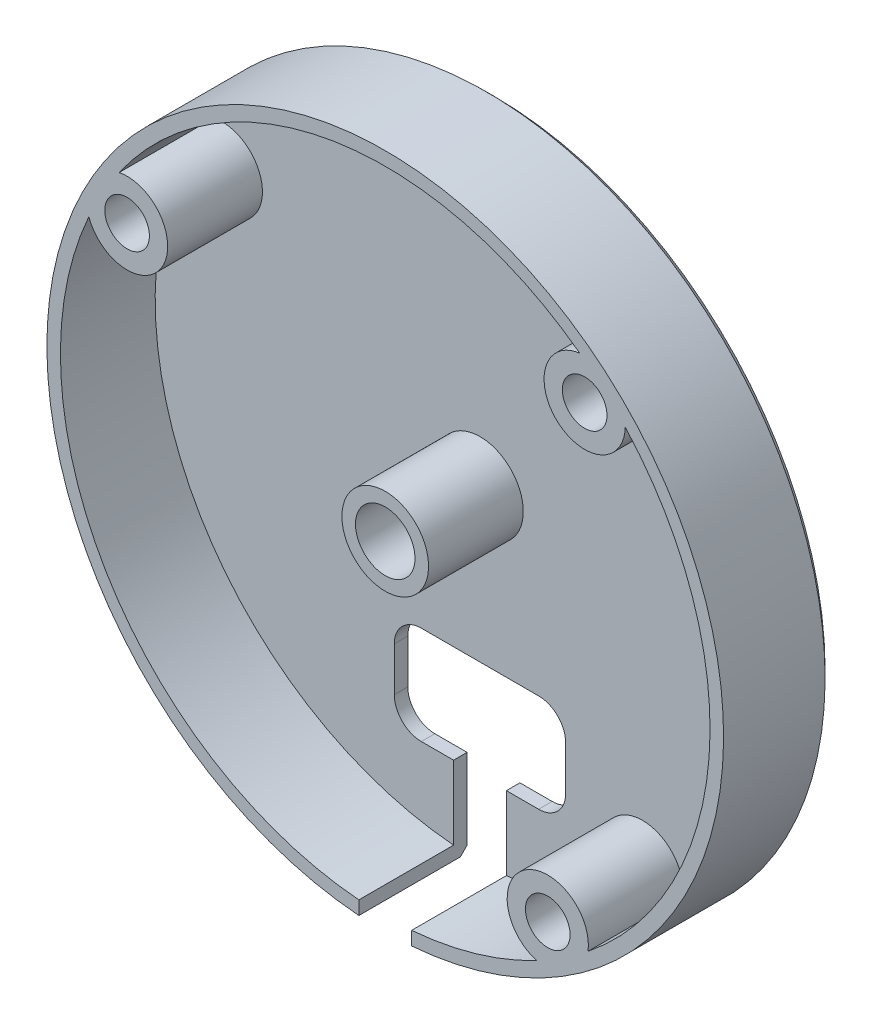
ISO-10303-21;
HEADER;
FILE_DESCRIPTION(('STEP AP214'),'2;1');
FILE_NAME('part.step','',(''),(''),'','','');
FILE_SCHEMA(('AUTOMOTIVE_DESIGN { 1 0 10303 214 1 1 1 1 }'));
ENDSEC;
DATA;
#1=APPLICATION_CONTEXT('core data for automotive mechanical design processes');
#2=APPLICATION_PROTOCOL_DEFINITION('international standard','automotive_design',2000,#1);
#3=PRODUCT_CONTEXT('',#1,'mechanical');
#4=PRODUCT('Part','Part','',(#3));
#5=PRODUCT_RELATED_PRODUCT_CATEGORY('part','',(#4));
#6=PRODUCT_DEFINITION_FORMATION('','',#4);
#7=PRODUCT_DEFINITION_CONTEXT('part definition',#1,'design');
#8=PRODUCT_DEFINITION('design','',#6,#7);
#9=PRODUCT_DEFINITION_SHAPE('','',#8);
#10=(LENGTH_UNIT() NAMED_UNIT(*) SI_UNIT(.MILLI.,.METRE.));
#11=(NAMED_UNIT(*) PLANE_ANGLE_UNIT() SI_UNIT($,.RADIAN.));
#12=(NAMED_UNIT(*) SI_UNIT($,.STERADIAN.) SOLID_ANGLE_UNIT());
#13=UNCERTAINTY_MEASURE_WITH_UNIT(LENGTH_MEASURE(1.E-05),#10,'distance_accuracy_value','');
#14=(GEOMETRIC_REPRESENTATION_CONTEXT(3) GLOBAL_UNCERTAINTY_ASSIGNED_CONTEXT((#13)) GLOBAL_UNIT_ASSIGNED_CONTEXT((#10,
#11,#12)) REPRESENTATION_CONTEXT('',''));
#15=CARTESIAN_POINT('',(0.,0.,0.));
#16=DIRECTION('',(0.,0.,1.));
#17=DIRECTION('',(1.,0.,0.));
#18=AXIS2_PLACEMENT_3D('',#15,#16,#17);
#19=CARTESIAN_POINT('',(0.,0.,-9.));
#20=DIRECTION('',(0.,0.,-1.));
#21=DIRECTION('',(-1.,0.,0.));
#22=AXIS2_PLACEMENT_3D('',#19,#20,#21);
#23=PLANE('',#22);
#24=CARTESIAN_POINT('',(0.,0.,-9.));
#25=DIRECTION('',(0.,0.,-1.));
#26=DIRECTION('',(-1.,0.,0.));
#27=AXIS2_PLACEMENT_3D('',#24,#25,#26);
#28=CIRCLE('',#27,3.2);
#29=CARTESIAN_POINT('',(-3.2,0.,-9.));
#30=VERTEX_POINT('',#29);
#31=EDGE_CURVE('E326',#30,#30,#28,.T.);
#32=ORIENTED_EDGE('',*,*,#31,.T.);
#33=EDGE_LOOP('',(#32));
#34=FACE_BOUND('',#33,.T.);
#35=DIRECTION('',(0.,1.,0.));
#36=VECTOR('',#35,1.);
#37=CARTESIAN_POINT('',(1.95,0.,-9.));
#38=LINE('',#37,#36);
#39=CARTESIAN_POINT('',(1.95,-23.9206500747785,-9.));
#40=VERTEX_POINT('',#39);
#41=CARTESIAN_POINT('',(1.95,-18.4814555776076,-9.));
#42=VERTEX_POINT('',#41);
#43=EDGE_CURVE('E494',#40,#42,#38,.T.);
#44=ORIENTED_EDGE('',*,*,#43,.F.);
#45=CARTESIAN_POINT('',(0.,0.,-9.));
#46=DIRECTION('',(0.,0.,-1.));
#47=DIRECTION('',(-1.,0.,0.));
#48=AXIS2_PLACEMENT_3D('',#45,#46,#47);
#49=CIRCLE('',#48,24.);
#50=CARTESIAN_POINT('',(11.1833588227535,-21.2351709539043,-9.));
#51=VERTEX_POINT('',#50);
#52=EDGE_CURVE('E325',#51,#40,#49,.T.);
#53=ORIENTED_EDGE('',*,*,#52,.F.);
#54=CARTESIAN_POINT('',(12.00918454324,-18.3510745825286,-9.));
#55=DIRECTION('',(0.,0.,-1.));
#56=DIRECTION('',(-1.,0.,0.));
#57=AXIS2_PLACEMENT_3D('',#54,#55,#56);
#58=CIRCLE('',#57,3.);
#59=CARTESIAN_POINT('',(14.9826990358569,-18.7488327530258,-9.));
#60=VERTEX_POINT('',#59);
#61=EDGE_CURVE('E277',#51,#60,#58,.T.);
#62=ORIENTED_EDGE('',*,*,#61,.T.);
#63=CARTESIAN_POINT('',(17.7346250390881,16.1704382971813,-9.));
#64=VERTEX_POINT('',#63);
#65=EDGE_CURVE('E320',#64,#60,#49,.T.);
#66=ORIENTED_EDGE('',*,*,#65,.F.);
#67=CARTESIAN_POINT('',(14.7355117330946,16.2433723620113,-9.));
#68=DIRECTION('',(0.,0.,-1.));
#69=DIRECTION('',(-1.,0.,0.));
#70=AXIS2_PLACEMENT_3D('',#67,#68,#69);
#71=CIRCLE('',#70,3.);
#72=CARTESIAN_POINT('',(14.371655882494,19.2212254342739,-9.));
#73=VERTEX_POINT('',#72);
#74=EDGE_CURVE('E296',#64,#73,#71,.T.);
#75=ORIENTED_EDGE('',*,*,#74,.T.);
#76=CARTESIAN_POINT('',(-19.6594045017494,13.7661837353929,-9.));
#77=VERTEX_POINT('',#76);
#78=EDGE_CURVE('E335',#77,#73,#49,.T.);
#79=ORIENTED_EDGE('',*,*,#78,.F.);
#80=CARTESIAN_POINT('',(-19.0742703827249,10.8238006769259,-9.));
#81=DIRECTION('',(0.,0.,-1.));
#82=DIRECTION('',(-1.,0.,0.));
#83=AXIS2_PLACEMENT_3D('',#80,#81,#82);
#84=CIRCLE('',#83,3.);
#85=CARTESIAN_POINT('',(-21.9003251075439,9.81711567538458,-9.));
#86=VERTEX_POINT('',#85);
#87=EDGE_CURVE('E259',#77,#86,#84,.T.);
#88=ORIENTED_EDGE('',*,*,#87,.T.);
#89=CARTESIAN_POINT('',(-1.95,-23.9206500747785,-9.));
#90=VERTEX_POINT('',#89);
#91=EDGE_CURVE('E213',#90,#86,#49,.T.);
#92=ORIENTED_EDGE('',*,*,#91,.F.);
#93=DIRECTION('',(0.,1.,0.));
#94=VECTOR('',#93,1.);
#95=CARTESIAN_POINT('',(-1.95,0.,-9.));
#96=LINE('',#95,#94);
#97=CARTESIAN_POINT('',(-1.95,-18.4814555776076,-9.00000000000001));
#98=VERTEX_POINT('',#97);
#99=EDGE_CURVE('E195',#90,#98,#96,.T.);
#100=ORIENTED_EDGE('',*,*,#99,.T.);
#101=DIRECTION('',(1.,0.,0.));
#102=VECTOR('',#101,1.);
#103=CARTESIAN_POINT('',(0.,-18.4814555776076,-9.));
#104=LINE('',#103,#102);
#105=CARTESIAN_POINT('',(-4.33229155248715,-18.4814555776076,-9.));
#106=VERTEX_POINT('',#105);
#107=EDGE_CURVE('E211',#106,#98,#104,.T.);
#108=ORIENTED_EDGE('',*,*,#107,.F.);
#109=CARTESIAN_POINT('',(-4.33229155248716,-16.4814555776076,-9.00000000000001));
#110=DIRECTION('',(0.,0.,-1.));
#111=DIRECTION('',(-1.,0.,0.));
#112=AXIS2_PLACEMENT_3D('',#109,#110,#111);
#113=CIRCLE('',#112,2.);
#114=CARTESIAN_POINT('',(-6.33229155248716,-16.4814555776076,-9.00000000000001));
#115=VERTEX_POINT('',#114);
#116=EDGE_CURVE('E247',#115,#106,#113,.F.);
#117=ORIENTED_EDGE('',*,*,#116,.F.);
#118=DIRECTION('',(0.,-1.,0.));
#119=VECTOR('',#118,1.);
#120=CARTESIAN_POINT('',(-6.33229155248716,0.,-9.));
#121=LINE('',#120,#119);
#122=CARTESIAN_POINT('',(-6.33229155248716,-13.2289331322741,-9.00000000000001));
#123=VERTEX_POINT('',#122);
#124=EDGE_CURVE('E244',#123,#115,#121,.T.);
#125=ORIENTED_EDGE('',*,*,#124,.F.);
#126=CARTESIAN_POINT('',(-4.33229155248716,-13.2289331322741,-9.00000000000001));
#127=DIRECTION('',(0.,0.,-1.));
#128=DIRECTION('',(-1.,0.,0.));
#129=AXIS2_PLACEMENT_3D('',#126,#127,#128);
#130=CIRCLE('',#129,2.);
#131=CARTESIAN_POINT('',(-4.33229155248715,-11.2289331322741,-9.00000000000001));
#132=VERTEX_POINT('',#131);
#133=EDGE_CURVE('E241',#132,#123,#130,.F.);
#134=ORIENTED_EDGE('',*,*,#133,.F.);
#135=DIRECTION('',(-1.,0.,0.));
#136=VECTOR('',#135,1.);
#137=CARTESIAN_POINT('',(0.,-11.2289331322741,-9.));
#138=LINE('',#137,#136);
#139=CARTESIAN_POINT('',(4.33229155248716,-11.2289331322741,-9.00000000000001));
#140=VERTEX_POINT('',#139);
#141=EDGE_CURVE('E238',#140,#132,#138,.T.);
#142=ORIENTED_EDGE('',*,*,#141,.F.);
#143=CARTESIAN_POINT('',(4.33229155248716,-13.2289331322741,-9.00000000000001));
#144=DIRECTION('',(0.,0.,-1.));
#145=DIRECTION('',(-1.,0.,0.));
#146=AXIS2_PLACEMENT_3D('',#143,#144,#145);
#147=CIRCLE('',#146,2.);
#148=CARTESIAN_POINT('',(6.33229155248716,-13.2289331322741,-9.00000000000001));
#149=VERTEX_POINT('',#148);
#150=EDGE_CURVE('E235',#149,#140,#147,.F.);
#151=ORIENTED_EDGE('',*,*,#150,.F.);
#152=DIRECTION('',(0.,1.,0.));
#153=VECTOR('',#152,1.);
#154=CARTESIAN_POINT('',(6.33229155248716,0.,-9.));
#155=LINE('',#154,#153);
#156=CARTESIAN_POINT('',(6.33229155248716,-16.4814555776076,-9.00000000000001));
#157=VERTEX_POINT('',#156);
#158=EDGE_CURVE('E227',#157,#149,#155,.T.);
#159=ORIENTED_EDGE('',*,*,#158,.F.);
#160=CARTESIAN_POINT('',(4.33229155248716,-16.4814555776076,-9.00000000000001));
#161=DIRECTION('',(0.,0.,-1.));
#162=DIRECTION('',(-1.,0.,0.));
#163=AXIS2_PLACEMENT_3D('',#160,#161,#162);
#164=CIRCLE('',#163,2.);
#165=CARTESIAN_POINT('',(4.33229155248716,-18.4814555776076,-9.00000000000001));
#166=VERTEX_POINT('',#165);
#167=EDGE_CURVE('E222',#166,#157,#164,.F.);
#168=ORIENTED_EDGE('',*,*,#167,.F.);
#169=EDGE_CURVE('E223',#42,#166,#104,.T.);
#170=ORIENTED_EDGE('',*,*,#169,.F.);
#171=EDGE_LOOP('',(#44,#53,#62,#66,#75,#79,#88,#92,#100,#108,#117,#125,#134,#142,#151,#159,#168,#170));
#172=FACE_BOUND('',#171,.T.);
#173=ADVANCED_FACE('F44',(#34,#172),#23,.F.);
#174=CARTESIAN_POINT('',(0.,0.,-10.));
#175=DIRECTION('',(0.,0.,-1.));
#176=DIRECTION('',(-1.,0.,0.));
#177=AXIS2_PLACEMENT_3D('',#174,#175,#176);
#178=PLANE('',#177);
#179=CARTESIAN_POINT('',(14.7355117330946,16.2433723620113,-10.));
#180=DIRECTION('',(0.,0.,-1.));
#181=DIRECTION('',(-1.,0.,0.));
#182=AXIS2_PLACEMENT_3D('',#179,#180,#181);
#183=CIRCLE('',#182,1.65);
#184=CARTESIAN_POINT('',(13.0855117330946,16.2433723620113,-10.));
#185=VERTEX_POINT('',#184);
#186=EDGE_CURVE('E315',#185,#185,#183,.T.);
#187=ORIENTED_EDGE('',*,*,#186,.F.);
#188=EDGE_LOOP('',(#187));
#189=FACE_BOUND('',#188,.T.);
#190=CARTESIAN_POINT('',(12.00918454324,-18.3510745825286,-10.));
#191=DIRECTION('',(0.,0.,-1.));
#192=DIRECTION('',(-1.,0.,0.));
#193=AXIS2_PLACEMENT_3D('',#190,#191,#192);
#194=CIRCLE('',#193,1.65000000000001);
#195=CARTESIAN_POINT('',(10.35918454324,-18.3510745825286,-10.));
#196=VERTEX_POINT('',#195);
#197=EDGE_CURVE('E311',#196,#196,#194,.T.);
#198=ORIENTED_EDGE('',*,*,#197,.F.);
#199=EDGE_LOOP('',(#198));
#200=FACE_BOUND('',#199,.T.);
#201=CARTESIAN_POINT('',(-19.0742703827249,10.8238006769259,-10.));
#202=DIRECTION('',(0.,0.,-1.));
#203=DIRECTION('',(-1.,0.,0.));
#204=AXIS2_PLACEMENT_3D('',#201,#202,#203);
#205=CIRCLE('',#204,1.65);
#206=CARTESIAN_POINT('',(-20.7242703827249,10.8238006769259,-10.));
#207=VERTEX_POINT('',#206);
#208=EDGE_CURVE('E300',#207,#207,#205,.T.);
#209=ORIENTED_EDGE('',*,*,#208,.F.);
#210=EDGE_LOOP('',(#209));
#211=FACE_BOUND('',#210,.T.);
#212=CARTESIAN_POINT('',(0.,0.,-10.));
#213=DIRECTION('',(0.,0.,-1.));
#214=DIRECTION('',(-1.,0.,0.));
#215=AXIS2_PLACEMENT_3D('',#212,#213,#214);
#216=CIRCLE('',#215,2.2);
#217=CARTESIAN_POINT('',(-2.2,0.,-10.));
#218=VERTEX_POINT('',#217);
#219=EDGE_CURVE('E341',#218,#218,#216,.T.);
#220=ORIENTED_EDGE('',*,*,#219,.F.);
#221=EDGE_LOOP('',(#220));
#222=FACE_BOUND('',#221,.T.);
#223=DIRECTION('',(0.,1.,0.));
#224=VECTOR('',#223,1.);
#225=CARTESIAN_POINT('',(-1.95,0.,-10.));
#226=LINE('',#225,#224);
#227=CARTESIAN_POINT('',(-1.95,-24.4222746688346,-10.));
#228=VERTEX_POINT('',#227);
#229=CARTESIAN_POINT('',(-1.95,-18.4814555776076,-10.));
#230=VERTEX_POINT('',#229);
#231=EDGE_CURVE('E198',#228,#230,#226,.T.);
#232=ORIENTED_EDGE('',*,*,#231,.F.);
#233=CARTESIAN_POINT('',(0.,0.,-10.));
#234=DIRECTION('',(0.,0.,-1.));
#235=DIRECTION('',(-1.,0.,0.));
#236=AXIS2_PLACEMENT_3D('',#233,#234,#235);
#237=CIRCLE('',#236,24.5);
#238=CARTESIAN_POINT('',(1.95,-24.4222746688346,-10.));
#239=VERTEX_POINT('',#238);
#240=EDGE_CURVE('E386',#228,#239,#237,.T.);
#241=ORIENTED_EDGE('',*,*,#240,.T.);
#242=DIRECTION('',(0.,1.,0.));
#243=VECTOR('',#242,1.);
#244=CARTESIAN_POINT('',(1.95,0.,-10.));
#245=LINE('',#244,#243);
#246=CARTESIAN_POINT('',(1.95,-18.4814555776076,-9.99999999999999));
#247=VERTEX_POINT('',#246);
#248=EDGE_CURVE('E574',#239,#247,#245,.T.);
#249=ORIENTED_EDGE('',*,*,#248,.T.);
#250=DIRECTION('',(1.,0.,0.));
#251=VECTOR('',#250,1.);
#252=CARTESIAN_POINT('',(0.,-18.4814555776076,-10.));
#253=LINE('',#252,#251);
#254=CARTESIAN_POINT('',(4.33229155248716,-18.4814555776076,-10.));
#255=VERTEX_POINT('',#254);
#256=EDGE_CURVE('E352',#247,#255,#253,.T.);
#257=ORIENTED_EDGE('',*,*,#256,.T.);
#258=CARTESIAN_POINT('',(4.33229155248716,-16.4814555776076,-9.99999999999999));
#259=DIRECTION('',(0.,0.,-1.));
#260=DIRECTION('',(-1.,0.,0.));
#261=AXIS2_PLACEMENT_3D('',#258,#259,#260);
#262=CIRCLE('',#261,2.);
#263=CARTESIAN_POINT('',(6.33229155248716,-16.4814555776076,-9.99999999999999));
#264=VERTEX_POINT('',#263);
#265=EDGE_CURVE('E356',#255,#264,#262,.F.);
#266=ORIENTED_EDGE('',*,*,#265,.T.);
#267=DIRECTION('',(0.,1.,0.));
#268=VECTOR('',#267,1.);
#269=CARTESIAN_POINT('',(6.33229155248716,0.,-10.));
#270=LINE('',#269,#268);
#271=CARTESIAN_POINT('',(6.33229155248716,-13.2289331322741,-9.99999999999999));
#272=VERTEX_POINT('',#271);
#273=EDGE_CURVE('E360',#264,#272,#270,.T.);
#274=ORIENTED_EDGE('',*,*,#273,.T.);
#275=CARTESIAN_POINT('',(4.33229155248716,-13.2289331322741,-9.99999999999999));
#276=DIRECTION('',(0.,0.,-1.));
#277=DIRECTION('',(-1.,0.,0.));
#278=AXIS2_PLACEMENT_3D('',#275,#276,#277);
#279=CIRCLE('',#278,2.);
#280=CARTESIAN_POINT('',(4.33229155248716,-11.2289331322741,-9.99999999999999));
#281=VERTEX_POINT('',#280);
#282=EDGE_CURVE('E364',#272,#281,#279,.F.);
#283=ORIENTED_EDGE('',*,*,#282,.T.);
#284=DIRECTION('',(-1.,0.,0.));
#285=VECTOR('',#284,1.);
#286=CARTESIAN_POINT('',(0.,-11.2289331322741,-10.));
#287=LINE('',#286,#285);
#288=CARTESIAN_POINT('',(-4.33229155248715,-11.2289331322741,-9.99999999999999));
#289=VERTEX_POINT('',#288);
#290=EDGE_CURVE('E368',#281,#289,#287,.T.);
#291=ORIENTED_EDGE('',*,*,#290,.T.);
#292=CARTESIAN_POINT('',(-4.33229155248716,-13.2289331322741,-9.99999999999999));
#293=DIRECTION('',(0.,0.,-1.));
#294=DIRECTION('',(-1.,0.,0.));
#295=AXIS2_PLACEMENT_3D('',#292,#293,#294);
#296=CIRCLE('',#295,2.);
#297=CARTESIAN_POINT('',(-6.33229155248716,-13.2289331322741,-9.99999999999999));
#298=VERTEX_POINT('',#297);
#299=EDGE_CURVE('E372',#289,#298,#296,.F.);
#300=ORIENTED_EDGE('',*,*,#299,.T.);
#301=DIRECTION('',(0.,-1.,0.));
#302=VECTOR('',#301,1.);
#303=CARTESIAN_POINT('',(-6.33229155248716,0.,-10.));
#304=LINE('',#303,#302);
#305=CARTESIAN_POINT('',(-6.33229155248716,-16.4814555776076,-9.99999999999999));
#306=VERTEX_POINT('',#305);
#307=EDGE_CURVE('E376',#298,#306,#304,.T.);
#308=ORIENTED_EDGE('',*,*,#307,.T.);
#309=CARTESIAN_POINT('',(-4.33229155248716,-16.4814555776076,-9.99999999999999));
#310=DIRECTION('',(0.,0.,-1.));
#311=DIRECTION('',(-1.,0.,0.));
#312=AXIS2_PLACEMENT_3D('',#309,#310,#311);
#313=CIRCLE('',#312,2.);
#314=CARTESIAN_POINT('',(-4.33229155248715,-18.4814555776076,-9.99999999999999));
#315=VERTEX_POINT('',#314);
#316=EDGE_CURVE('E204',#306,#315,#313,.F.);
#317=ORIENTED_EDGE('',*,*,#316,.T.);
#318=EDGE_CURVE('E353',#315,#230,#253,.T.);
#319=ORIENTED_EDGE('',*,*,#318,.T.);
#320=EDGE_LOOP('',(#232,#241,#249,#257,#266,#274,#283,#291,#300,#308,#317,#319));
#321=FACE_BOUND('',#320,.T.);
#322=ADVANCED_FACE('F460',(#189,#200,#211,#222,#321),#178,.T.);
#323=CARTESIAN_POINT('',(0.,0.,-10.));
#324=DIRECTION('',(0.,0.,1.));
#325=DIRECTION('',(1.,0.,0.));
#326=AXIS2_PLACEMENT_3D('',#323,#324,#325);
#327=CYLINDRICAL_SURFACE('',#326,24.);
#328=ORIENTED_EDGE('',*,*,#52,.T.);
#329=DIRECTION('',(0.,0.,1.));
#330=VECTOR('',#329,1.);
#331=CARTESIAN_POINT('',(1.95,-23.9206500747785,-10.));
#332=LINE('',#331,#330);
#333=CARTESIAN_POINT('',(1.95,-23.9206500747785,-2.));
#334=VERTEX_POINT('',#333);
#335=EDGE_CURVE('E524',#40,#334,#332,.T.);
#336=ORIENTED_EDGE('',*,*,#335,.T.);
#337=CARTESIAN_POINT('',(0.,0.,-2.));
#338=DIRECTION('',(0.,0.,-1.));
#339=DIRECTION('',(-1.,0.,0.));
#340=AXIS2_PLACEMENT_3D('',#337,#338,#339);
#341=CIRCLE('',#340,24.);
#342=CARTESIAN_POINT('',(11.1833588227535,-21.2351709539043,-2.));
#343=VERTEX_POINT('',#342);
#344=EDGE_CURVE('E336',#343,#334,#341,.T.);
#345=ORIENTED_EDGE('',*,*,#344,.F.);
#346=DIRECTION('',(0.,0.,1.));
#347=VECTOR('',#346,1.);
#348=CARTESIAN_POINT('',(11.1833588227535,-21.2351709539043,-5.5));
#349=LINE('',#348,#347);
#350=EDGE_CURVE('E282',#51,#343,#349,.T.);
#351=ORIENTED_EDGE('',*,*,#350,.F.);
#352=EDGE_LOOP('',(#328,#336,#345,#351));
#353=FACE_BOUND('',#352,.T.);
#354=ADVANCED_FACE('F468',(#353),#327,.F.);
#355=CARTESIAN_POINT('',(0.,0.,-2.));
#356=DIRECTION('',(0.,0.,-1.));
#357=DIRECTION('',(-1.,0.,0.));
#358=AXIS2_PLACEMENT_3D('',#355,#356,#357);
#359=PLANE('',#358);
#360=CARTESIAN_POINT('',(-19.0742703827249,10.8238006769259,-2.));
#361=DIRECTION('',(0.,0.,-1.));
#362=DIRECTION('',(-1.,0.,0.));
#363=AXIS2_PLACEMENT_3D('',#360,#361,#362);
#364=CIRCLE('',#363,1.65);
#365=CARTESIAN_POINT('',(-20.7242703827249,10.8238006769259,-2.));
#366=VERTEX_POINT('',#365);
#367=EDGE_CURVE('E251',#366,#366,#364,.T.);
#368=ORIENTED_EDGE('',*,*,#367,.T.);
#369=EDGE_LOOP('',(#368));
#370=FACE_BOUND('',#369,.T.);
#371=CARTESIAN_POINT('',(12.00918454324,-18.3510745825286,-2.));
#372=DIRECTION('',(0.,0.,-1.));
#373=DIRECTION('',(-1.,0.,0.));
#374=AXIS2_PLACEMENT_3D('',#371,#372,#373);
#375=CIRCLE('',#374,1.65);
#376=CARTESIAN_POINT('',(10.35918454324,-18.3510745825286,-2.));
#377=VERTEX_POINT('',#376);
#378=EDGE_CURVE('E270',#377,#377,#375,.T.);
#379=ORIENTED_EDGE('',*,*,#378,.T.);
#380=EDGE_LOOP('',(#379));
#381=FACE_BOUND('',#380,.T.);
#382=CARTESIAN_POINT('',(14.7355117330946,16.2433723620113,-2.));
#383=DIRECTION('',(0.,0.,-1.));
#384=DIRECTION('',(-1.,0.,0.));
#385=AXIS2_PLACEMENT_3D('',#382,#383,#384);
#386=CIRCLE('',#385,1.65);
#387=CARTESIAN_POINT('',(13.0855117330946,16.2433723620113,-2.));
#388=VERTEX_POINT('',#387);
#389=EDGE_CURVE('E288',#388,#388,#386,.T.);
#390=ORIENTED_EDGE('',*,*,#389,.T.);
#391=EDGE_LOOP('',(#390));
#392=FACE_BOUND('',#391,.T.);
#393=DIRECTION('',(0.,1.,0.));
#394=VECTOR('',#393,1.);
#395=CARTESIAN_POINT('',(1.95,0.,-2.));
#396=LINE('',#395,#394);
#397=CARTESIAN_POINT('',(1.95,-24.9238339747319,-2.));
#398=VERTEX_POINT('',#397);
#399=EDGE_CURVE('E493',#398,#334,#396,.T.);
#400=ORIENTED_EDGE('',*,*,#399,.F.);
#401=CARTESIAN_POINT('',(0.,0.,-2.));
#402=DIRECTION('',(0.,0.,-1.));
#403=DIRECTION('',(-1.,0.,0.));
#404=AXIS2_PLACEMENT_3D('',#401,#402,#403);
#405=CIRCLE('',#404,25.);
#406=CARTESIAN_POINT('',(-1.95,-24.9238339747319,-2.));
#407=VERTEX_POINT('',#406);
#408=EDGE_CURVE('E345',#407,#398,#405,.T.);
#409=ORIENTED_EDGE('',*,*,#408,.F.);
#410=DIRECTION('',(0.,1.,0.));
#411=VECTOR('',#410,1.);
#412=CARTESIAN_POINT('',(-1.95,0.,-2.));
#413=LINE('',#412,#411);
#414=CARTESIAN_POINT('',(-1.95,-23.9206500747785,-2.));
#415=VERTEX_POINT('',#414);
#416=EDGE_CURVE('E583',#407,#415,#413,.T.);
#417=ORIENTED_EDGE('',*,*,#416,.T.);
#418=CARTESIAN_POINT('',(-21.9003251075439,9.81711567538458,-2.));
#419=VERTEX_POINT('',#418);
#420=EDGE_CURVE('E337',#415,#419,#341,.T.);
#421=ORIENTED_EDGE('',*,*,#420,.T.);
#422=CARTESIAN_POINT('',(-19.0742703827249,10.8238006769259,-2.));
#423=DIRECTION('',(0.,0.,-1.));
#424=DIRECTION('',(-1.,0.,0.));
#425=AXIS2_PLACEMENT_3D('',#422,#423,#424);
#426=CIRCLE('',#425,3.);
#427=CARTESIAN_POINT('',(-19.6594045017494,13.7661837353929,-2.));
#428=VERTEX_POINT('',#427);
#429=EDGE_CURVE('E250',#428,#419,#426,.T.);
#430=ORIENTED_EDGE('',*,*,#429,.F.);
#431=CARTESIAN_POINT('',(14.371655882494,19.2212254342739,-2.));
#432=VERTEX_POINT('',#431);
#433=EDGE_CURVE('E330',#428,#432,#341,.T.);
#434=ORIENTED_EDGE('',*,*,#433,.T.);
#435=CARTESIAN_POINT('',(14.7355117330946,16.2433723620113,-2.));
#436=DIRECTION('',(0.,0.,-1.));
#437=DIRECTION('',(-1.,0.,0.));
#438=AXIS2_PLACEMENT_3D('',#435,#436,#437);
#439=CIRCLE('',#438,3.);
#440=CARTESIAN_POINT('',(17.7346250390881,16.1704382971813,-2.));
#441=VERTEX_POINT('',#440);
#442=EDGE_CURVE('E281',#441,#432,#439,.T.);
#443=ORIENTED_EDGE('',*,*,#442,.F.);
#444=CARTESIAN_POINT('',(14.9826990358569,-18.7488327530258,-2.));
#445=VERTEX_POINT('',#444);
#446=EDGE_CURVE('E331',#441,#445,#341,.T.);
#447=ORIENTED_EDGE('',*,*,#446,.T.);
#448=CARTESIAN_POINT('',(12.00918454324,-18.3510745825286,-2.));
#449=DIRECTION('',(0.,0.,-1.));
#450=DIRECTION('',(-1.,0.,0.));
#451=AXIS2_PLACEMENT_3D('',#448,#449,#450);
#452=CIRCLE('',#451,3.);
#453=EDGE_CURVE('E262',#343,#445,#452,.T.);
#454=ORIENTED_EDGE('',*,*,#453,.F.);
#455=ORIENTED_EDGE('',*,*,#344,.T.);
#456=EDGE_LOOP('',(#400,#409,#417,#421,#430,#434,#443,#447,#454,#455));
#457=FACE_BOUND('',#456,.T.);
#458=ADVANCED_FACE('F479',(#370,#381,#392,#457),#359,.F.);
#459=CARTESIAN_POINT('',(0.,0.,-10.));
#460=DIRECTION('',(0.,0.,1.));
#461=DIRECTION('',(1.,0.,0.));
#462=AXIS2_PLACEMENT_3D('',#459,#460,#461);
#463=CYLINDRICAL_SURFACE('',#462,25.);
#464=DIRECTION('',(0.,0.,1.));
#465=VECTOR('',#464,1.);
#466=CARTESIAN_POINT('',(1.95,-24.9238339747319,-10.));
#467=LINE('',#466,#465);
#468=CARTESIAN_POINT('',(1.95,-24.9238339747319,-9.49999999999999));
#469=VERTEX_POINT('',#468);
#470=EDGE_CURVE('E489',#469,#398,#467,.T.);
#471=ORIENTED_EDGE('',*,*,#470,.F.);
#472=CARTESIAN_POINT('',(0.,0.,-9.49999999999999));
#473=DIRECTION('',(0.,0.,-1.));
#474=DIRECTION('',(-1.,0.,0.));
#475=AXIS2_PLACEMENT_3D('',#472,#473,#474);
#476=CIRCLE('',#475,25.);
#477=CARTESIAN_POINT('',(-1.95,-24.9238339747319,-9.49999999999999));
#478=VERTEX_POINT('',#477);
#479=EDGE_CURVE('E60',#469,#478,#476,.F.);
#480=ORIENTED_EDGE('',*,*,#479,.T.);
#481=DIRECTION('',(0.,0.,1.));
#482=VECTOR('',#481,1.);
#483=CARTESIAN_POINT('',(-1.95,-24.9238339747319,-10.));
#484=LINE('',#483,#482);
#485=EDGE_CURVE('E215',#478,#407,#484,.T.);
#486=ORIENTED_EDGE('',*,*,#485,.T.);
#487=ORIENTED_EDGE('',*,*,#408,.T.);
#488=EDGE_LOOP('',(#471,#480,#486,#487));
#489=FACE_BOUND('',#488,.T.);
#490=ADVANCED_FACE('F481',(#489),#463,.T.);
#491=CARTESIAN_POINT('',(4.33229155248716,-18.4814555776076,-78.));
#492=DIRECTION('',(0.,1.,0.));
#493=DIRECTION('',(0.,0.,1.));
#494=AXIS2_PLACEMENT_3D('',#491,#492,#493);
#495=PLANE('',#494);
#496=ORIENTED_EDGE('',*,*,#256,.F.);
#497=DIRECTION('',(0.,0.,1.));
#498=VECTOR('',#497,1.);
#499=CARTESIAN_POINT('',(1.95,-18.4814555776076,-78.));
#500=LINE('',#499,#498);
#501=EDGE_CURVE('E203',#247,#42,#500,.T.);
#502=ORIENTED_EDGE('',*,*,#501,.T.);
#503=ORIENTED_EDGE('',*,*,#169,.T.);
#504=DIRECTION('',(0.,0.,1.));
#505=VECTOR('',#504,1.);
#506=CARTESIAN_POINT('',(4.33229155248716,-18.4814555776076,-78.));
#507=LINE('',#506,#505);
#508=EDGE_CURVE('E529',#255,#166,#507,.T.);
#509=ORIENTED_EDGE('',*,*,#508,.F.);
#510=EDGE_LOOP('',(#496,#502,#503,#509));
#511=FACE_BOUND('',#510,.T.);
#512=ADVANCED_FACE('F405',(#511),#495,.T.);
#513=DIRECTION('',(0.,0.,1.));
#514=VECTOR('',#513,1.);
#515=CARTESIAN_POINT('',(-1.95,-23.9206500747785,-10.));
#516=LINE('',#515,#514);
#517=EDGE_CURVE('E578',#90,#415,#516,.T.);
#518=ORIENTED_EDGE('',*,*,#517,.F.);
#519=ORIENTED_EDGE('',*,*,#91,.T.);
#520=DIRECTION('',(0.,0.,1.));
#521=VECTOR('',#520,1.);
#522=CARTESIAN_POINT('',(-21.9003251075439,9.81711567538458,-5.5));
#523=LINE('',#522,#521);
#524=EDGE_CURVE('E255',#419,#86,#523,.F.);
#525=ORIENTED_EDGE('',*,*,#524,.F.);
#526=ORIENTED_EDGE('',*,*,#420,.F.);
#527=EDGE_LOOP('',(#518,#519,#525,#526));
#528=FACE_BOUND('',#527,.T.);
#529=ADVANCED_FACE('F487',(#528),#327,.F.);
#530=ORIENTED_EDGE('',*,*,#433,.F.);
#531=DIRECTION('',(0.,0.,1.));
#532=VECTOR('',#531,1.);
#533=CARTESIAN_POINT('',(-19.6594045017494,13.7661837353929,-5.5));
#534=LINE('',#533,#532);
#535=EDGE_CURVE('E263',#77,#428,#534,.T.);
#536=ORIENTED_EDGE('',*,*,#535,.F.);
#537=ORIENTED_EDGE('',*,*,#78,.T.);
#538=DIRECTION('',(0.,0.,1.));
#539=VECTOR('',#538,1.);
#540=CARTESIAN_POINT('',(14.371655882494,19.2212254342738,-5.5));
#541=LINE('',#540,#539);
#542=EDGE_CURVE('E292',#432,#73,#541,.F.);
#543=ORIENTED_EDGE('',*,*,#542,.F.);
#544=EDGE_LOOP('',(#530,#536,#537,#543));
#545=FACE_BOUND('',#544,.T.);
#546=ADVANCED_FACE('F466',(#545),#327,.F.);
#547=ORIENTED_EDGE('',*,*,#65,.T.);
#548=DIRECTION('',(0.,0.,1.));
#549=VECTOR('',#548,1.);
#550=CARTESIAN_POINT('',(14.9826990358569,-18.7488327530258,-5.5));
#551=LINE('',#550,#549);
#552=EDGE_CURVE('E274',#445,#60,#551,.F.);
#553=ORIENTED_EDGE('',*,*,#552,.F.);
#554=ORIENTED_EDGE('',*,*,#446,.F.);
#555=DIRECTION('',(0.,0.,1.));
#556=VECTOR('',#555,1.);
#557=CARTESIAN_POINT('',(17.7346250390881,16.1704382971813,-5.5));
#558=LINE('',#557,#556);
#559=EDGE_CURVE('E301',#64,#441,#558,.T.);
#560=ORIENTED_EDGE('',*,*,#559,.F.);
#561=EDGE_LOOP('',(#547,#553,#554,#560));
#562=FACE_BOUND('',#561,.T.);
#563=ADVANCED_FACE('F462',(#562),#327,.F.);
#564=CARTESIAN_POINT('',(0.,0.,-2.));
#565=DIRECTION('',(0.,0.,-1.));
#566=DIRECTION('',(-1.,0.,0.));
#567=AXIS2_PLACEMENT_3D('',#564,#565,#566);
#568=CIRCLE('',#567,2.2);
#569=CARTESIAN_POINT('',(-2.2,0.,-2.));
#570=VERTEX_POINT('',#569);
#571=EDGE_CURVE('E324',#570,#570,#568,.T.);
#572=ORIENTED_EDGE('',*,*,#571,.T.);
#573=EDGE_LOOP('',(#572));
#574=FACE_BOUND('',#573,.T.);
#575=CARTESIAN_POINT('',(0.,0.,-2.));
#576=DIRECTION('',(0.,0.,-1.));
#577=DIRECTION('',(-1.,0.,0.));
#578=AXIS2_PLACEMENT_3D('',#575,#576,#577);
#579=CIRCLE('',#578,3.2);
#580=CARTESIAN_POINT('',(-3.2,0.,-2.));
#581=VERTEX_POINT('',#580);
#582=EDGE_CURVE('E319',#581,#581,#579,.T.);
#583=ORIENTED_EDGE('',*,*,#582,.F.);
#584=EDGE_LOOP('',(#583));
#585=FACE_BOUND('',#584,.T.);
#586=ADVANCED_FACE('F465',(#574,#585),#359,.F.);
#587=CARTESIAN_POINT('',(0.,0.,-10.));
#588=DIRECTION('',(0.,0.,1.));
#589=DIRECTION('',(1.,0.,0.));
#590=AXIS2_PLACEMENT_3D('',#587,#588,#589);
#591=CYLINDRICAL_SURFACE('',#590,2.2);
#592=ORIENTED_EDGE('',*,*,#219,.T.);
#593=EDGE_LOOP('',(#592));
#594=FACE_BOUND('',#593,.T.);
#595=ORIENTED_EDGE('',*,*,#571,.F.);
#596=EDGE_LOOP('',(#595));
#597=FACE_BOUND('',#596,.T.);
#598=ADVANCED_FACE('F471',(#594,#597),#591,.F.);
#599=CARTESIAN_POINT('',(0.,0.,-10.));
#600=DIRECTION('',(0.,0.,1.));
#601=DIRECTION('',(1.,0.,0.));
#602=AXIS2_PLACEMENT_3D('',#599,#600,#601);
#603=CYLINDRICAL_SURFACE('',#602,3.2);
#604=ORIENTED_EDGE('',*,*,#31,.F.);
#605=EDGE_LOOP('',(#604));
#606=FACE_BOUND('',#605,.T.);
#607=ORIENTED_EDGE('',*,*,#582,.T.);
#608=EDGE_LOOP('',(#607));
#609=FACE_BOUND('',#608,.T.);
#610=ADVANCED_FACE('F456',(#606,#609),#603,.T.);
#611=CARTESIAN_POINT('',(-19.0742703827249,10.8238006769259,-22.));
#612=DIRECTION('',(0.,0.,1.));
#613=DIRECTION('',(1.,0.,0.));
#614=AXIS2_PLACEMENT_3D('',#611,#612,#613);
#615=CYLINDRICAL_SURFACE('',#614,1.65);
#616=ORIENTED_EDGE('',*,*,#208,.T.);
#617=EDGE_LOOP('',(#616));
#618=FACE_BOUND('',#617,.T.);
#619=ORIENTED_EDGE('',*,*,#367,.F.);
#620=EDGE_LOOP('',(#619));
#621=FACE_BOUND('',#620,.T.);
#622=ADVANCED_FACE('F452',(#618,#621),#615,.F.);
#623=CARTESIAN_POINT('',(12.00918454324,-18.3510745825286,-22.));
#624=DIRECTION('',(0.,0.,1.));
#625=DIRECTION('',(1.,0.,0.));
#626=AXIS2_PLACEMENT_3D('',#623,#624,#625);
#627=CYLINDRICAL_SURFACE('',#626,1.65000000000001);
#628=ORIENTED_EDGE('',*,*,#197,.T.);
#629=EDGE_LOOP('',(#628));
#630=FACE_BOUND('',#629,.T.);
#631=ORIENTED_EDGE('',*,*,#378,.F.);
#632=EDGE_LOOP('',(#631));
#633=FACE_BOUND('',#632,.T.);
#634=ADVANCED_FACE('F448',(#630,#633),#627,.F.);
#635=CARTESIAN_POINT('',(14.7355117330946,16.2433723620113,-22.));
#636=DIRECTION('',(0.,0.,1.));
#637=DIRECTION('',(1.,0.,0.));
#638=AXIS2_PLACEMENT_3D('',#635,#636,#637);
#639=CYLINDRICAL_SURFACE('',#638,1.65);
#640=ORIENTED_EDGE('',*,*,#186,.T.);
#641=EDGE_LOOP('',(#640));
#642=FACE_BOUND('',#641,.T.);
#643=ORIENTED_EDGE('',*,*,#389,.F.);
#644=EDGE_LOOP('',(#643));
#645=FACE_BOUND('',#644,.T.);
#646=ADVANCED_FACE('F444',(#642,#645),#639,.F.);
#647=CARTESIAN_POINT('',(14.7355117330946,16.2433723620113,-10.002));
#648=DIRECTION('',(0.,0.,1.));
#649=DIRECTION('',(1.,0.,0.));
#650=AXIS2_PLACEMENT_3D('',#647,#648,#649);
#651=CYLINDRICAL_SURFACE('',#650,3.);
#652=ORIENTED_EDGE('',*,*,#74,.F.);
#653=ORIENTED_EDGE('',*,*,#559,.T.);
#654=ORIENTED_EDGE('',*,*,#442,.T.);
#655=ORIENTED_EDGE('',*,*,#542,.T.);
#656=EDGE_LOOP('',(#652,#653,#654,#655));
#657=FACE_BOUND('',#656,.T.);
#658=ADVANCED_FACE('F440',(#657),#651,.T.);
#659=CARTESIAN_POINT('',(12.00918454324,-18.3510745825286,-10.002));
#660=DIRECTION('',(0.,0.,1.));
#661=DIRECTION('',(1.,0.,0.));
#662=AXIS2_PLACEMENT_3D('',#659,#660,#661);
#663=CYLINDRICAL_SURFACE('',#662,3.);
#664=ORIENTED_EDGE('',*,*,#61,.F.);
#665=ORIENTED_EDGE('',*,*,#350,.T.);
#666=ORIENTED_EDGE('',*,*,#453,.T.);
#667=ORIENTED_EDGE('',*,*,#552,.T.);
#668=EDGE_LOOP('',(#664,#665,#666,#667));
#669=FACE_BOUND('',#668,.T.);
#670=ADVANCED_FACE('F436',(#669),#663,.T.);
#671=CARTESIAN_POINT('',(-19.0742703827249,10.8238006769259,-10.002));
#672=DIRECTION('',(0.,0.,1.));
#673=DIRECTION('',(1.,0.,0.));
#674=AXIS2_PLACEMENT_3D('',#671,#672,#673);
#675=CYLINDRICAL_SURFACE('',#674,3.);
#676=ORIENTED_EDGE('',*,*,#87,.F.);
#677=ORIENTED_EDGE('',*,*,#535,.T.);
#678=ORIENTED_EDGE('',*,*,#429,.T.);
#679=ORIENTED_EDGE('',*,*,#524,.T.);
#680=EDGE_LOOP('',(#676,#677,#678,#679));
#681=FACE_BOUND('',#680,.T.);
#682=ADVANCED_FACE('F432',(#681),#675,.T.);
#683=CARTESIAN_POINT('',(-4.33229155248716,-16.4814555776076,-78.));
#684=DIRECTION('',(0.,0.,1.));
#685=DIRECTION('',(1.,0.,0.));
#686=AXIS2_PLACEMENT_3D('',#683,#684,#685);
#687=CYLINDRICAL_SURFACE('',#686,2.);
#688=ORIENTED_EDGE('',*,*,#116,.T.);
#689=DIRECTION('',(0.,0.,1.));
#690=VECTOR('',#689,1.);
#691=CARTESIAN_POINT('',(-4.33229155248715,-18.4814555776076,-78.));
#692=LINE('',#691,#690);
#693=EDGE_CURVE('E219',#315,#106,#692,.T.);
#694=ORIENTED_EDGE('',*,*,#693,.F.);
#695=ORIENTED_EDGE('',*,*,#316,.F.);
#696=DIRECTION('',(0.,0.,1.));
#697=VECTOR('',#696,1.);
#698=CARTESIAN_POINT('',(-6.33229155248716,-16.4814555776076,-78.));
#699=LINE('',#698,#697);
#700=EDGE_CURVE('E229',#306,#115,#699,.T.);
#701=ORIENTED_EDGE('',*,*,#700,.T.);
#702=EDGE_LOOP('',(#688,#694,#695,#701));
#703=FACE_BOUND('',#702,.T.);
#704=ADVANCED_FACE('F428',(#703),#687,.F.);
#705=CARTESIAN_POINT('',(-6.33229155248716,-16.4814555776076,-78.));
#706=DIRECTION('',(1.,0.,0.));
#707=DIRECTION('',(0.,0.,-1.));
#708=AXIS2_PLACEMENT_3D('',#705,#706,#707);
#709=PLANE('',#708);
#710=ORIENTED_EDGE('',*,*,#124,.T.);
#711=ORIENTED_EDGE('',*,*,#700,.F.);
#712=ORIENTED_EDGE('',*,*,#307,.F.);
#713=DIRECTION('',(0.,0.,1.));
#714=VECTOR('',#713,1.);
#715=CARTESIAN_POINT('',(-6.33229155248716,-13.2289331322741,-78.));
#716=LINE('',#715,#714);
#717=EDGE_CURVE('E551',#298,#123,#716,.T.);
#718=ORIENTED_EDGE('',*,*,#717,.T.);
#719=EDGE_LOOP('',(#710,#711,#712,#718));
#720=FACE_BOUND('',#719,.T.);
#721=ADVANCED_FACE('F424',(#720),#709,.T.);
#722=CARTESIAN_POINT('',(-4.33229155248716,-13.2289331322741,-78.));
#723=DIRECTION('',(0.,0.,1.));
#724=DIRECTION('',(1.,0.,0.));
#725=AXIS2_PLACEMENT_3D('',#722,#723,#724);
#726=CYLINDRICAL_SURFACE('',#725,2.);
#727=ORIENTED_EDGE('',*,*,#133,.T.);
#728=ORIENTED_EDGE('',*,*,#717,.F.);
#729=ORIENTED_EDGE('',*,*,#299,.F.);
#730=DIRECTION('',(0.,0.,1.));
#731=VECTOR('',#730,1.);
#732=CARTESIAN_POINT('',(-4.33229155248715,-11.2289331322741,-78.));
#733=LINE('',#732,#731);
#734=EDGE_CURVE('E548',#289,#132,#733,.T.);
#735=ORIENTED_EDGE('',*,*,#734,.T.);
#736=EDGE_LOOP('',(#727,#728,#729,#735));
#737=FACE_BOUND('',#736,.T.);
#738=ADVANCED_FACE('F420',(#737),#726,.F.);
#739=CARTESIAN_POINT('',(-4.33229155248715,-11.2289331322741,-78.));
#740=DIRECTION('',(0.,-1.,0.));
#741=DIRECTION('',(0.,0.,-1.));
#742=AXIS2_PLACEMENT_3D('',#739,#740,#741);
#743=PLANE('',#742);
#744=ORIENTED_EDGE('',*,*,#141,.T.);
#745=ORIENTED_EDGE('',*,*,#734,.F.);
#746=ORIENTED_EDGE('',*,*,#290,.F.);
#747=DIRECTION('',(0.,0.,1.));
#748=VECTOR('',#747,1.);
#749=CARTESIAN_POINT('',(4.33229155248716,-11.2289331322741,-78.));
#750=LINE('',#749,#748);
#751=EDGE_CURVE('E544',#281,#140,#750,.T.);
#752=ORIENTED_EDGE('',*,*,#751,.T.);
#753=EDGE_LOOP('',(#744,#745,#746,#752));
#754=FACE_BOUND('',#753,.T.);
#755=ADVANCED_FACE('F416',(#754),#743,.T.);
#756=CARTESIAN_POINT('',(4.33229155248716,-13.2289331322741,-78.));
#757=DIRECTION('',(0.,0.,1.));
#758=DIRECTION('',(1.,0.,0.));
#759=AXIS2_PLACEMENT_3D('',#756,#757,#758);
#760=CYLINDRICAL_SURFACE('',#759,2.);
#761=ORIENTED_EDGE('',*,*,#150,.T.);
#762=ORIENTED_EDGE('',*,*,#751,.F.);
#763=ORIENTED_EDGE('',*,*,#282,.F.);
#764=DIRECTION('',(0.,0.,1.));
#765=VECTOR('',#764,1.);
#766=CARTESIAN_POINT('',(6.33229155248716,-13.2289331322741,-78.));
#767=LINE('',#766,#765);
#768=EDGE_CURVE('E540',#272,#149,#767,.T.);
#769=ORIENTED_EDGE('',*,*,#768,.T.);
#770=EDGE_LOOP('',(#761,#762,#763,#769));
#771=FACE_BOUND('',#770,.T.);
#772=ADVANCED_FACE('F412',(#771),#760,.F.);
#773=CARTESIAN_POINT('',(6.33229155248716,-13.2289331322741,-78.));
#774=DIRECTION('',(-1.,0.,0.));
#775=DIRECTION('',(0.,-1.,0.));
#776=AXIS2_PLACEMENT_3D('',#773,#774,#775);
#777=PLANE('',#776);
#778=ORIENTED_EDGE('',*,*,#158,.T.);
#779=ORIENTED_EDGE('',*,*,#768,.F.);
#780=ORIENTED_EDGE('',*,*,#273,.F.);
#781=DIRECTION('',(0.,0.,1.));
#782=VECTOR('',#781,1.);
#783=CARTESIAN_POINT('',(6.33229155248716,-16.4814555776076,-78.));
#784=LINE('',#783,#782);
#785=EDGE_CURVE('E536',#264,#157,#784,.T.);
#786=ORIENTED_EDGE('',*,*,#785,.T.);
#787=EDGE_LOOP('',(#778,#779,#780,#786));
#788=FACE_BOUND('',#787,.T.);
#789=ADVANCED_FACE('F408',(#788),#777,.T.);
#790=CARTESIAN_POINT('',(4.33229155248716,-16.4814555776076,-78.));
#791=DIRECTION('',(0.,0.,1.));
#792=DIRECTION('',(1.,0.,0.));
#793=AXIS2_PLACEMENT_3D('',#790,#791,#792);
#794=CYLINDRICAL_SURFACE('',#793,2.);
#795=ORIENTED_EDGE('',*,*,#167,.T.);
#796=ORIENTED_EDGE('',*,*,#785,.F.);
#797=ORIENTED_EDGE('',*,*,#265,.F.);
#798=ORIENTED_EDGE('',*,*,#508,.T.);
#799=EDGE_LOOP('',(#795,#796,#797,#798));
#800=FACE_BOUND('',#799,.T.);
#801=ADVANCED_FACE('F404',(#800),#794,.F.);
#802=DIRECTION('',(0.,0.,1.));
#803=VECTOR('',#802,1.);
#804=CARTESIAN_POINT('',(-1.95,-18.4814555776076,-78.));
#805=LINE('',#804,#803);
#806=EDGE_CURVE('E192',#230,#98,#805,.T.);
#807=ORIENTED_EDGE('',*,*,#806,.F.);
#808=ORIENTED_EDGE('',*,*,#318,.F.);
#809=ORIENTED_EDGE('',*,*,#693,.T.);
#810=ORIENTED_EDGE('',*,*,#107,.T.);
#811=EDGE_LOOP('',(#807,#808,#809,#810));
#812=FACE_BOUND('',#811,.T.);
#813=ADVANCED_FACE('F217',(#812),#495,.T.);
#814=CARTESIAN_POINT('',(-1.95,-18.2814555776076,-16.));
#815=DIRECTION('',(-1.,0.,0.));
#816=DIRECTION('',(0.,0.,1.));
#817=AXIS2_PLACEMENT_3D('',#814,#815,#816);
#818=PLANE('',#817);
#819=ORIENTED_EDGE('',*,*,#485,.F.);
#820=CARTESIAN_POINT('',(-1.95,-24.9238339747319,-9.49999999999999));
#821=CARTESIAN_POINT('',(-1.95,-24.8402433862572,-9.58333597070717));
#822=CARTESIAN_POINT('',(-1.95,-24.7566514831953,-9.66667062272733));
#823=CARTESIAN_POINT('',(-1.95,-24.5894650478961,-9.833337289394));
#824=CARTESIAN_POINT('',(-1.95,-24.505870515659,-9.91666930404051));
#825=CARTESIAN_POINT('',(-1.95,-24.4222746688346,-10.));
#826=B_SPLINE_CURVE_WITH_KNOTS('',3,(#820,#821,#822,#823,#824,#825),.UNSPECIFIED.,.F.,.F.,(4,2,
4),(0.,0.354105117674999,0.70821023535178),.UNSPECIFIED.);
#827=EDGE_CURVE('E11',#478,#228,#826,.T.);
#828=ORIENTED_EDGE('',*,*,#827,.T.);
#829=ORIENTED_EDGE('',*,*,#231,.T.);
#830=ORIENTED_EDGE('',*,*,#806,.T.);
#831=ORIENTED_EDGE('',*,*,#99,.F.);
#832=ORIENTED_EDGE('',*,*,#517,.T.);
#833=ORIENTED_EDGE('',*,*,#416,.F.);
#834=EDGE_LOOP('',(#819,#828,#829,#830,#831,#832,#833));
#835=FACE_BOUND('',#834,.T.);
#836=ADVANCED_FACE('F194',(#835),#818,.F.);
#837=CARTESIAN_POINT('',(1.95,-18.2814555776076,-16.));
#838=DIRECTION('',(-1.,0.,0.));
#839=DIRECTION('',(0.,0.,1.));
#840=AXIS2_PLACEMENT_3D('',#837,#838,#839);
#841=PLANE('',#840);
#842=ORIENTED_EDGE('',*,*,#248,.F.);
#843=CARTESIAN_POINT('',(1.95,-24.4222746688346,-10.));
#844=CARTESIAN_POINT('',(1.95,-24.505870515659,-9.91666930404051));
#845=CARTESIAN_POINT('',(1.95,-24.5894650478961,-9.833337289394));
#846=CARTESIAN_POINT('',(1.95,-24.7566514831953,-9.66667062272733));
#847=CARTESIAN_POINT('',(1.95,-24.8402433862572,-9.58333597070717));
#848=CARTESIAN_POINT('',(1.95,-24.9238339747319,-9.49999999999998));
#849=B_SPLINE_CURVE_WITH_KNOTS('',3,(#843,#844,#845,#846,#847,#848),.UNSPECIFIED.,.F.,.F.,(4,2,
4),(0.,0.354105117676782,0.708210235351781),.UNSPECIFIED.);
#850=EDGE_CURVE('E74',#239,#469,#849,.T.);
#851=ORIENTED_EDGE('',*,*,#850,.T.);
#852=ORIENTED_EDGE('',*,*,#470,.T.);
#853=ORIENTED_EDGE('',*,*,#399,.T.);
#854=ORIENTED_EDGE('',*,*,#335,.F.);
#855=ORIENTED_EDGE('',*,*,#43,.T.);
#856=ORIENTED_EDGE('',*,*,#501,.F.);
#857=EDGE_LOOP('',(#842,#851,#852,#853,#854,#855,#856));
#858=FACE_BOUND('',#857,.T.);
#859=ADVANCED_FACE('F396',(#858),#841,.T.);
#860=CARTESIAN_POINT('',(0.,0.,-10.));
#861=DIRECTION('',(0.,0.,1.));
#862=DIRECTION('',(1.,0.,0.));
#863=AXIS2_PLACEMENT_3D('',#860,#861,#862);
#864=CONICAL_SURFACE('',#863,24.5,0.785398163397448);
#865=ORIENTED_EDGE('',*,*,#827,.F.);
#866=ORIENTED_EDGE('',*,*,#479,.F.);
#867=ORIENTED_EDGE('',*,*,#850,.F.);
#868=ORIENTED_EDGE('',*,*,#240,.F.);
#869=EDGE_LOOP('',(#865,#866,#867,#868));
#870=FACE_BOUND('',#869,.T.);
#871=ADVANCED_FACE('F47',(#870),#864,.T.);
#872=CLOSED_SHELL('',(#173,#322,#354,#458,#490,#512,#529,#546,#563,#586,#598,#610,#622,#634,
#646,#658,#670,#682,#704,#721,#738,#755,#772,#789,#801,#813,#836,#859,#871));
#873=MANIFOLD_SOLID_BREP('B2',#872);
#874=ADVANCED_BREP_SHAPE_REPRESENTATION('',(#18,#873),#14);
#875=SHAPE_DEFINITION_REPRESENTATION(#9,#874);
ENDSEC;
END-ISO-10303-21;
